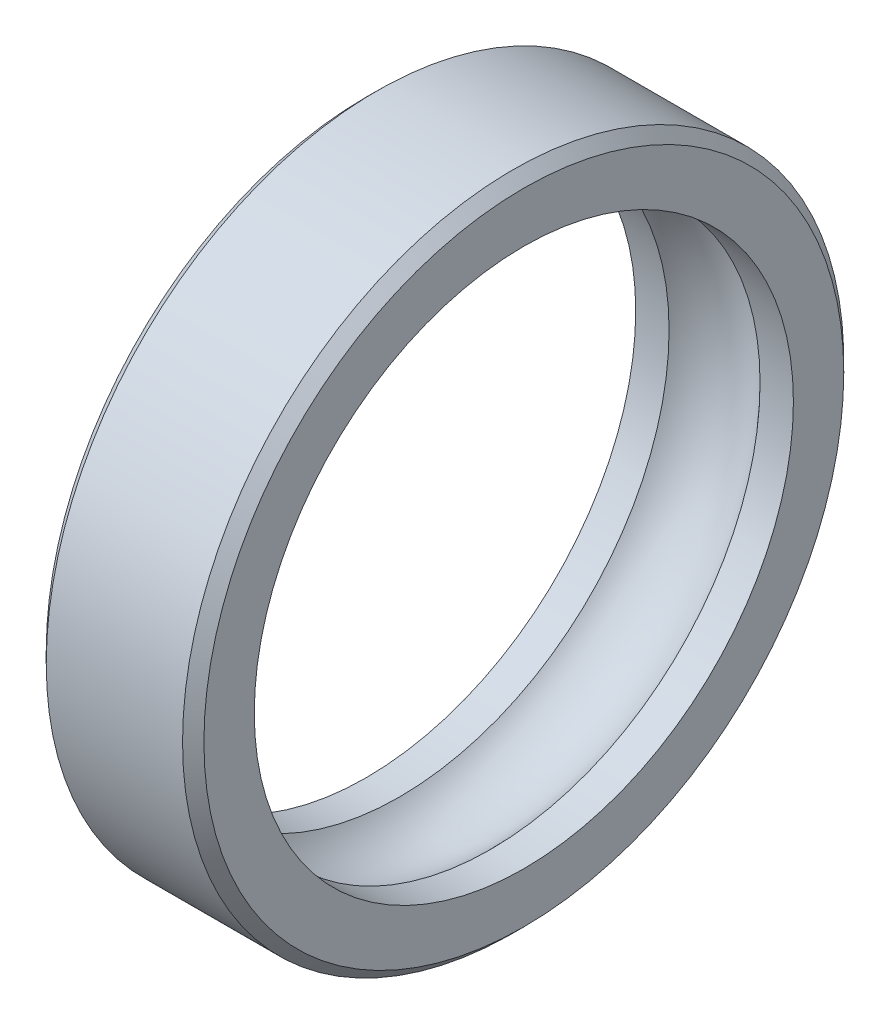
ISO-10303-21;
HEADER;
FILE_DESCRIPTION(('STEP AP214'),'2;1');
FILE_NAME('part.step','',(''),(''),'','','');
FILE_SCHEMA(('AUTOMOTIVE_DESIGN { 1 0 10303 214 1 1 1 1 }'));
ENDSEC;
DATA;
#1=APPLICATION_CONTEXT('core data for automotive mechanical design processes');
#2=APPLICATION_PROTOCOL_DEFINITION('international standard','automotive_design',2000,#1);
#3=PRODUCT_CONTEXT('',#1,'mechanical');
#4=PRODUCT('Part','Part','',(#3));
#5=PRODUCT_RELATED_PRODUCT_CATEGORY('part','',(#4));
#6=PRODUCT_DEFINITION_FORMATION('','',#4);
#7=PRODUCT_DEFINITION_CONTEXT('part definition',#1,'design');
#8=PRODUCT_DEFINITION('design','',#6,#7);
#9=PRODUCT_DEFINITION_SHAPE('','',#8);
#10=(LENGTH_UNIT() NAMED_UNIT(*) SI_UNIT(.MILLI.,.METRE.));
#11=(NAMED_UNIT(*) PLANE_ANGLE_UNIT() SI_UNIT($,.RADIAN.));
#12=(NAMED_UNIT(*) SI_UNIT($,.STERADIAN.) SOLID_ANGLE_UNIT());
#13=UNCERTAINTY_MEASURE_WITH_UNIT(LENGTH_MEASURE(1.E-05),#10,'distance_accuracy_value','');
#14=(GEOMETRIC_REPRESENTATION_CONTEXT(3) GLOBAL_UNCERTAINTY_ASSIGNED_CONTEXT((#13)) GLOBAL_UNIT_ASSIGNED_CONTEXT((#10,
#11,#12)) REPRESENTATION_CONTEXT('',''));
#15=CARTESIAN_POINT('',(0.,0.,0.));
#16=DIRECTION('',(0.,0.,1.));
#17=DIRECTION('',(1.,0.,0.));
#18=AXIS2_PLACEMENT_3D('',#15,#16,#17);
#19=CARTESIAN_POINT('',(-47.3654644555873,0.,0.));
#20=DIRECTION('',(-1.,0.,0.));
#21=DIRECTION('',(0.,0.,1.));
#22=AXIS2_PLACEMENT_3D('',#19,#20,#21);
#23=CYLINDRICAL_SURFACE('',#22,53.);
#24=CARTESIAN_POINT('',(15.5,0.,0.));
#25=DIRECTION('',(-1.,0.,0.));
#26=DIRECTION('',(0.,0.,1.));
#27=AXIS2_PLACEMENT_3D('',#24,#25,#26);
#28=CIRCLE('',#27,53.);
#29=CARTESIAN_POINT('',(15.5,0.,53.));
#30=VERTEX_POINT('',#29);
#31=EDGE_CURVE('E72',#30,#30,#28,.T.);
#32=ORIENTED_EDGE('',*,*,#31,.F.);
#33=EDGE_LOOP('',(#32));
#34=FACE_BOUND('',#33,.T.);
#35=CARTESIAN_POINT('',(8.94427190999916,0.,0.));
#36=DIRECTION('',(-1.,0.,0.));
#37=DIRECTION('',(0.,0.,1.));
#38=AXIS2_PLACEMENT_3D('',#35,#36,#37);
#39=CIRCLE('',#38,53.);
#40=CARTESIAN_POINT('',(8.94427190999916,0.,53.));
#41=VERTEX_POINT('',#40);
#42=EDGE_CURVE('E63',#41,#41,#39,.T.);
#43=ORIENTED_EDGE('',*,*,#42,.T.);
#44=EDGE_LOOP('',(#43));
#45=FACE_BOUND('',#44,.T.);
#46=ADVANCED_FACE('F43',(#34,#45),#23,.F.);
#47=CARTESIAN_POINT('',(0.,0.,0.));
#48=DIRECTION('',(-1.,0.,0.));
#49=DIRECTION('',(0.,0.,1.));
#50=AXIS2_PLACEMENT_3D('',#47,#48,#49);
#51=TOROIDAL_SURFACE('',#50,45.,12.);
#52=ORIENTED_EDGE('',*,*,#42,.F.);
#53=EDGE_LOOP('',(#52));
#54=FACE_BOUND('',#53,.T.);
#55=CARTESIAN_POINT('',(-8.94427190999916,0.,0.));
#56=DIRECTION('',(-1.,0.,0.));
#57=DIRECTION('',(0.,0.,1.));
#58=AXIS2_PLACEMENT_3D('',#55,#56,#57);
#59=CIRCLE('',#58,53.);
#60=CARTESIAN_POINT('',(-8.94427190999916,0.,53.));
#61=VERTEX_POINT('',#60);
#62=EDGE_CURVE('E66',#61,#61,#59,.T.);
#63=ORIENTED_EDGE('',*,*,#62,.T.);
#64=EDGE_LOOP('',(#63));
#65=FACE_BOUND('',#64,.T.);
#66=ADVANCED_FACE('F80',(#54,#65),#51,.F.);
#67=CARTESIAN_POINT('',(-47.3654644555873,0.,0.));
#68=DIRECTION('',(-1.,0.,0.));
#69=DIRECTION('',(0.,0.,1.));
#70=AXIS2_PLACEMENT_3D('',#67,#68,#69);
#71=CYLINDRICAL_SURFACE('',#70,53.);
#72=ORIENTED_EDGE('',*,*,#62,.F.);
#73=EDGE_LOOP('',(#72));
#74=FACE_BOUND('',#73,.T.);
#75=CARTESIAN_POINT('',(-15.5,0.,0.));
#76=DIRECTION('',(-1.,0.,0.));
#77=DIRECTION('',(0.,0.,1.));
#78=AXIS2_PLACEMENT_3D('',#75,#76,#77);
#79=CIRCLE('',#78,53.);
#80=CARTESIAN_POINT('',(-15.5,0.,53.));
#81=VERTEX_POINT('',#80);
#82=EDGE_CURVE('E69',#81,#81,#79,.T.);
#83=ORIENTED_EDGE('',*,*,#82,.T.);
#84=EDGE_LOOP('',(#83));
#85=FACE_BOUND('',#84,.T.);
#86=ADVANCED_FACE('F86',(#74,#85),#71,.F.);
#87=CARTESIAN_POINT('',(-15.5,65.,0.));
#88=DIRECTION('',(1.,0.,0.));
#89=DIRECTION('',(0.,0.,-1.));
#90=AXIS2_PLACEMENT_3D('',#87,#88,#89);
#91=PLANE('',#90);
#92=CARTESIAN_POINT('',(-15.5,0.,0.));
#93=DIRECTION('',(1.,0.,0.));
#94=DIRECTION('',(0.,0.,-1.));
#95=AXIS2_PLACEMENT_3D('',#92,#93,#94);
#96=CIRCLE('',#95,62.9);
#97=CARTESIAN_POINT('',(-15.5,0.,-62.9));
#98=VERTEX_POINT('',#97);
#99=EDGE_CURVE('E11',#98,#98,#96,.F.);
#100=ORIENTED_EDGE('',*,*,#99,.T.);
#101=EDGE_LOOP('',(#100));
#102=FACE_BOUND('',#101,.T.);
#103=ORIENTED_EDGE('',*,*,#82,.F.);
#104=EDGE_LOOP('',(#103));
#105=FACE_BOUND('',#104,.T.);
#106=ADVANCED_FACE('F92',(#102,#105),#91,.F.);
#107=CARTESIAN_POINT('',(-47.3654644555873,0.,0.));
#108=DIRECTION('',(-1.,0.,0.));
#109=DIRECTION('',(0.,0.,1.));
#110=AXIS2_PLACEMENT_3D('',#107,#108,#109);
#111=CYLINDRICAL_SURFACE('',#110,65.);
#112=CARTESIAN_POINT('',(13.4,0.,0.));
#113=DIRECTION('',(-1.,0.,0.));
#114=DIRECTION('',(0.,0.,1.));
#115=AXIS2_PLACEMENT_3D('',#112,#113,#114);
#116=CIRCLE('',#115,65.);
#117=CARTESIAN_POINT('',(13.4,0.,65.));
#118=VERTEX_POINT('',#117);
#119=EDGE_CURVE('E54',#118,#118,#116,.T.);
#120=ORIENTED_EDGE('',*,*,#119,.T.);
#121=EDGE_LOOP('',(#120));
#122=FACE_BOUND('',#121,.T.);
#123=CARTESIAN_POINT('',(-13.4,0.,0.));
#124=DIRECTION('',(1.,0.,0.));
#125=DIRECTION('',(0.,0.,-1.));
#126=AXIS2_PLACEMENT_3D('',#123,#124,#125);
#127=CIRCLE('',#126,65.);
#128=CARTESIAN_POINT('',(-13.4,0.,-65.));
#129=VERTEX_POINT('',#128);
#130=EDGE_CURVE('E58',#129,#129,#127,.T.);
#131=ORIENTED_EDGE('',*,*,#130,.T.);
#132=EDGE_LOOP('',(#131));
#133=FACE_BOUND('',#132,.T.);
#134=ADVANCED_FACE('F97',(#122,#133),#111,.T.);
#135=CARTESIAN_POINT('',(15.5,65.,0.));
#136=DIRECTION('',(-1.,0.,0.));
#137=DIRECTION('',(0.,0.,1.));
#138=AXIS2_PLACEMENT_3D('',#135,#136,#137);
#139=PLANE('',#138);
#140=CARTESIAN_POINT('',(15.5,0.,0.));
#141=DIRECTION('',(-1.,0.,0.));
#142=DIRECTION('',(0.,0.,1.));
#143=AXIS2_PLACEMENT_3D('',#140,#141,#142);
#144=CIRCLE('',#143,62.9);
#145=CARTESIAN_POINT('',(15.5,0.,62.9));
#146=VERTEX_POINT('',#145);
#147=EDGE_CURVE('E50',#146,#146,#144,.F.);
#148=ORIENTED_EDGE('',*,*,#147,.T.);
#149=EDGE_LOOP('',(#148));
#150=FACE_BOUND('',#149,.T.);
#151=ORIENTED_EDGE('',*,*,#31,.T.);
#152=EDGE_LOOP('',(#151));
#153=FACE_BOUND('',#152,.T.);
#154=ADVANCED_FACE('F76',(#150,#153),#139,.F.);
#155=CARTESIAN_POINT('',(13.4,0.,0.));
#156=DIRECTION('',(-1.,0.,0.));
#157=DIRECTION('',(0.,0.,1.));
#158=AXIS2_PLACEMENT_3D('',#155,#156,#157);
#159=CONICAL_SURFACE('',#158,65.,0.785398163397448);
#160=ORIENTED_EDGE('',*,*,#147,.F.);
#161=EDGE_LOOP('',(#160));
#162=FACE_BOUND('',#161,.T.);
#163=ORIENTED_EDGE('',*,*,#119,.F.);
#164=EDGE_LOOP('',(#163));
#165=FACE_BOUND('',#164,.T.);
#166=ADVANCED_FACE('F105',(#162,#165),#159,.T.);
#167=CARTESIAN_POINT('',(-15.5,0.,0.));
#168=DIRECTION('',(1.,0.,0.));
#169=DIRECTION('',(0.,0.,-1.));
#170=AXIS2_PLACEMENT_3D('',#167,#168,#169);
#171=CONICAL_SURFACE('',#170,62.9,0.785398163397445);
#172=ORIENTED_EDGE('',*,*,#130,.F.);
#173=EDGE_LOOP('',(#172));
#174=FACE_BOUND('',#173,.T.);
#175=ORIENTED_EDGE('',*,*,#99,.F.);
#176=EDGE_LOOP('',(#175));
#177=FACE_BOUND('',#176,.T.);
#178=ADVANCED_FACE('F45',(#174,#177),#171,.T.);
#179=CLOSED_SHELL('',(#46,#66,#86,#106,#134,#154,#166,#178));
#180=MANIFOLD_SOLID_BREP('B2',#179);
#181=ADVANCED_BREP_SHAPE_REPRESENTATION('',(#18,#180),#14);
#182=SHAPE_DEFINITION_REPRESENTATION(#9,#181);
ENDSEC;
END-ISO-10303-21;
